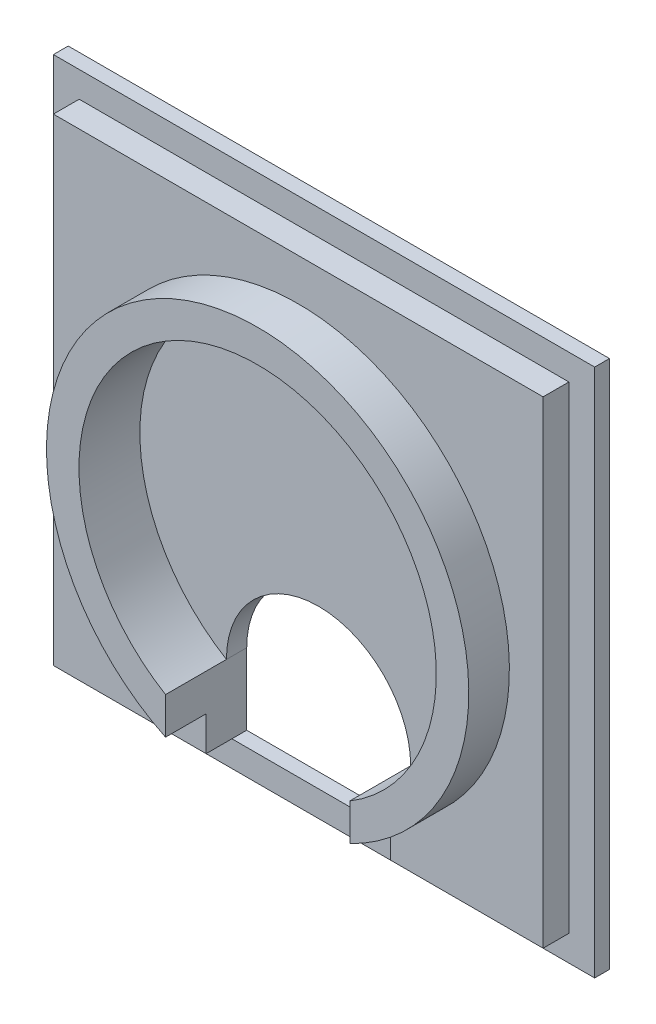
ISO-10303-21;
HEADER;
FILE_DESCRIPTION(('STEP AP214'),'2;1');
FILE_NAME('part.step','',(''),(''),'','','');
FILE_SCHEMA(('AUTOMOTIVE_DESIGN { 1 0 10303 214 1 1 1 1 }'));
ENDSEC;
DATA;
#1=APPLICATION_CONTEXT('core data for automotive mechanical design processes');
#2=APPLICATION_PROTOCOL_DEFINITION('international standard','automotive_design',2000,#1);
#3=PRODUCT_CONTEXT('',#1,'mechanical');
#4=PRODUCT('Part','Part','',(#3));
#5=PRODUCT_RELATED_PRODUCT_CATEGORY('part','',(#4));
#6=PRODUCT_DEFINITION_FORMATION('','',#4);
#7=PRODUCT_DEFINITION_CONTEXT('part definition',#1,'design');
#8=PRODUCT_DEFINITION('design','',#6,#7);
#9=PRODUCT_DEFINITION_SHAPE('','',#8);
#10=(LENGTH_UNIT() NAMED_UNIT(*) SI_UNIT(.MILLI.,.METRE.));
#11=(NAMED_UNIT(*) PLANE_ANGLE_UNIT() SI_UNIT($,.RADIAN.));
#12=(NAMED_UNIT(*) SI_UNIT($,.STERADIAN.) SOLID_ANGLE_UNIT());
#13=UNCERTAINTY_MEASURE_WITH_UNIT(LENGTH_MEASURE(1.E-05),#10,'distance_accuracy_value','');
#14=(GEOMETRIC_REPRESENTATION_CONTEXT(3) GLOBAL_UNCERTAINTY_ASSIGNED_CONTEXT((#13)) GLOBAL_UNIT_ASSIGNED_CONTEXT((#10,
#11,#12)) REPRESENTATION_CONTEXT('',''));
#15=CARTESIAN_POINT('',(0.,0.,0.));
#16=DIRECTION('',(0.,0.,1.));
#17=DIRECTION('',(1.,0.,0.));
#18=AXIS2_PLACEMENT_3D('',#15,#16,#17);
#19=CARTESIAN_POINT('',(-30.15,-27.65,-5.));
#20=DIRECTION('',(0.,-1.,0.));
#21=DIRECTION('',(1.,0.,0.));
#22=AXIS2_PLACEMENT_3D('',#19,#20,#21);
#23=PLANE('',#22);
#24=DIRECTION('',(0.,0.,1.));
#25=VECTOR('',#24,1.);
#26=CARTESIAN_POINT('',(11.3436105363328,-27.65,-28.875));
#27=LINE('',#26,#25);
#28=CARTESIAN_POINT('',(11.3436105363328,-27.65,-3.17500000000001));
#29=VERTEX_POINT('',#28);
#30=CARTESIAN_POINT('',(11.3436105363328,-27.65,0.));
#31=VERTEX_POINT('',#30);
#32=EDGE_CURVE('E270',#29,#31,#27,.T.);
#33=ORIENTED_EDGE('',*,*,#32,.F.);
#34=DIRECTION('',(1.,0.,0.));
#35=VECTOR('',#34,1.);
#36=CARTESIAN_POINT('',(-30.15,-27.65,-3.175));
#37=LINE('',#36,#35);
#38=CARTESIAN_POINT('',(30.15,-27.65,-3.175));
#39=VERTEX_POINT('',#38);
#40=EDGE_CURVE('E224',#29,#39,#37,.T.);
#41=ORIENTED_EDGE('',*,*,#40,.T.);
#42=DIRECTION('',(0.,0.,1.));
#43=VECTOR('',#42,1.);
#44=CARTESIAN_POINT('',(30.15,-27.65,-5.));
#45=LINE('',#44,#43);
#46=CARTESIAN_POINT('',(30.15,-27.65,0.));
#47=VERTEX_POINT('',#46);
#48=EDGE_CURVE('E174',#39,#47,#45,.T.);
#49=ORIENTED_EDGE('',*,*,#48,.T.);
#50=DIRECTION('',(1.,0.,0.));
#51=VECTOR('',#50,1.);
#52=CARTESIAN_POINT('',(-30.15,-27.65,0.));
#53=LINE('',#52,#51);
#54=EDGE_CURVE('E186',#31,#47,#53,.T.);
#55=ORIENTED_EDGE('',*,*,#54,.F.);
#56=EDGE_LOOP('',(#33,#41,#49,#55));
#57=FACE_BOUND('',#56,.T.);
#58=ADVANCED_FACE('F35',(#57),#23,.T.);
#59=CARTESIAN_POINT('',(30.15,31.15,-5.));
#60=DIRECTION('',(1.,0.,0.));
#61=DIRECTION('',(0.,0.,-1.));
#62=AXIS2_PLACEMENT_3D('',#59,#60,#61);
#63=PLANE('',#62);
#64=ORIENTED_EDGE('',*,*,#48,.F.);
#65=DIRECTION('',(0.,1.,0.));
#66=VECTOR('',#65,1.);
#67=CARTESIAN_POINT('',(30.15,31.15,-3.175));
#68=LINE('',#67,#66);
#69=CARTESIAN_POINT('',(30.15,31.15,-3.175));
#70=VERTEX_POINT('',#69);
#71=EDGE_CURVE('E211',#39,#70,#68,.T.);
#72=ORIENTED_EDGE('',*,*,#71,.T.);
#73=DIRECTION('',(0.,0.,1.));
#74=VECTOR('',#73,1.);
#75=CARTESIAN_POINT('',(30.15,31.15,-5.));
#76=LINE('',#75,#74);
#77=CARTESIAN_POINT('',(30.15,31.15,0.));
#78=VERTEX_POINT('',#77);
#79=EDGE_CURVE('E175',#70,#78,#76,.T.);
#80=ORIENTED_EDGE('',*,*,#79,.T.);
#81=DIRECTION('',(0.,1.,0.));
#82=VECTOR('',#81,1.);
#83=CARTESIAN_POINT('',(30.15,31.15,0.));
#84=LINE('',#83,#82);
#85=EDGE_CURVE('E193',#47,#78,#84,.T.);
#86=ORIENTED_EDGE('',*,*,#85,.F.);
#87=EDGE_LOOP('',(#64,#72,#80,#86));
#88=FACE_BOUND('',#87,.T.);
#89=ADVANCED_FACE('F37',(#88),#63,.T.);
#90=DIRECTION('',(0.,0.,1.));
#91=VECTOR('',#90,1.);
#92=CARTESIAN_POINT('',(-11.3436105363328,-27.65,-28.875));
#93=LINE('',#92,#91);
#94=CARTESIAN_POINT('',(-11.3436105363328,-27.65,-3.175));
#95=VERTEX_POINT('',#94);
#96=CARTESIAN_POINT('',(-11.3436105363328,-27.65,0.));
#97=VERTEX_POINT('',#96);
#98=EDGE_CURVE('E162',#95,#97,#93,.T.);
#99=ORIENTED_EDGE('',*,*,#98,.T.);
#100=CARTESIAN_POINT('',(-30.15,-27.65,0.));
#101=VERTEX_POINT('',#100);
#102=EDGE_CURVE('E178',#101,#97,#53,.T.);
#103=ORIENTED_EDGE('',*,*,#102,.F.);
#104=DIRECTION('',(0.,0.,1.));
#105=VECTOR('',#104,1.);
#106=CARTESIAN_POINT('',(-30.15,-27.65,-5.));
#107=LINE('',#106,#105);
#108=CARTESIAN_POINT('',(-30.15,-27.65,-3.175));
#109=VERTEX_POINT('',#108);
#110=EDGE_CURVE('E180',#109,#101,#107,.T.);
#111=ORIENTED_EDGE('',*,*,#110,.F.);
#112=EDGE_CURVE('E221',#109,#95,#37,.T.);
#113=ORIENTED_EDGE('',*,*,#112,.T.);
#114=EDGE_LOOP('',(#99,#103,#111,#113));
#115=FACE_BOUND('',#114,.T.);
#116=ADVANCED_FACE('F307',(#115),#23,.T.);
#117=CARTESIAN_POINT('',(-30.15,31.15,-5.));
#118=DIRECTION('',(-1.,0.,0.));
#119=DIRECTION('',(0.,0.,1.));
#120=AXIS2_PLACEMENT_3D('',#117,#118,#119);
#121=PLANE('',#120);
#122=DIRECTION('',(0.,0.,1.));
#123=VECTOR('',#122,1.);
#124=CARTESIAN_POINT('',(-30.15,31.15,-5.));
#125=LINE('',#124,#123);
#126=CARTESIAN_POINT('',(-30.15,31.15,-3.175));
#127=VERTEX_POINT('',#126);
#128=CARTESIAN_POINT('',(-30.15,31.15,0.));
#129=VERTEX_POINT('',#128);
#130=EDGE_CURVE('E177',#127,#129,#125,.T.);
#131=ORIENTED_EDGE('',*,*,#130,.F.);
#132=DIRECTION('',(0.,-1.,0.));
#133=VECTOR('',#132,1.);
#134=CARTESIAN_POINT('',(-30.15,31.15,-3.175));
#135=LINE('',#134,#133);
#136=EDGE_CURVE('E225',#127,#109,#135,.T.);
#137=ORIENTED_EDGE('',*,*,#136,.T.);
#138=ORIENTED_EDGE('',*,*,#110,.T.);
#139=DIRECTION('',(0.,-1.,0.));
#140=VECTOR('',#139,1.);
#141=CARTESIAN_POINT('',(-30.15,31.15,0.));
#142=LINE('',#141,#140);
#143=EDGE_CURVE('E187',#129,#101,#142,.T.);
#144=ORIENTED_EDGE('',*,*,#143,.F.);
#145=EDGE_LOOP('',(#131,#137,#138,#144));
#146=FACE_BOUND('',#145,.T.);
#147=ADVANCED_FACE('F312',(#146),#121,.T.);
#148=CARTESIAN_POINT('',(-30.15,31.15,-5.));
#149=DIRECTION('',(0.,1.,0.));
#150=DIRECTION('',(0.,0.,1.));
#151=AXIS2_PLACEMENT_3D('',#148,#149,#150);
#152=PLANE('',#151);
#153=ORIENTED_EDGE('',*,*,#79,.F.);
#154=DIRECTION('',(-1.,0.,0.));
#155=VECTOR('',#154,1.);
#156=CARTESIAN_POINT('',(-30.15,31.15,-3.175));
#157=LINE('',#156,#155);
#158=EDGE_CURVE('E228',#70,#127,#157,.T.);
#159=ORIENTED_EDGE('',*,*,#158,.T.);
#160=ORIENTED_EDGE('',*,*,#130,.T.);
#161=DIRECTION('',(-1.,0.,0.));
#162=VECTOR('',#161,1.);
#163=CARTESIAN_POINT('',(-30.15,31.15,0.));
#164=LINE('',#163,#162);
#165=EDGE_CURVE('E190',#78,#129,#164,.T.);
#166=ORIENTED_EDGE('',*,*,#165,.F.);
#167=EDGE_LOOP('',(#153,#159,#160,#166));
#168=FACE_BOUND('',#167,.T.);
#169=ADVANCED_FACE('F314',(#168),#152,.T.);
#170=CARTESIAN_POINT('',(0.,0.,-5.));
#171=DIRECTION('',(0.,0.,1.));
#172=DIRECTION('',(1.,0.,0.));
#173=AXIS2_PLACEMENT_3D('',#170,#171,#172);
#174=CYLINDRICAL_SURFACE('',#173,22.);
#175=CARTESIAN_POINT('',(0.,0.,-2.5));
#176=DIRECTION('',(0.,0.,1.));
#177=DIRECTION('',(1.,0.,0.));
#178=AXIS2_PLACEMENT_3D('',#175,#176,#177);
#179=CIRCLE('',#178,22.);
#180=CARTESIAN_POINT('',(-11.3436105363328,-18.85,-2.50000000000001));
#181=VERTEX_POINT('',#180);
#182=CARTESIAN_POINT('',(11.3436105363328,-18.85,-2.50000000000001));
#183=VERTEX_POINT('',#182);
#184=EDGE_CURVE('E153',#181,#183,#179,.F.);
#185=ORIENTED_EDGE('',*,*,#184,.T.);
#186=DIRECTION('',(0.,0.,-1.));
#187=VECTOR('',#186,1.);
#188=CARTESIAN_POINT('',(11.3436105363328,-18.85,5.));
#189=LINE('',#188,#187);
#190=CARTESIAN_POINT('',(11.3436105363328,-18.85,5.));
#191=VERTEX_POINT('',#190);
#192=EDGE_CURVE('E196',#191,#183,#189,.T.);
#193=ORIENTED_EDGE('',*,*,#192,.F.);
#194=CARTESIAN_POINT('',(0.,0.,5.));
#195=DIRECTION('',(0.,0.,1.));
#196=DIRECTION('',(1.,0.,0.));
#197=AXIS2_PLACEMENT_3D('',#194,#195,#196);
#198=CIRCLE('',#197,22.);
#199=CARTESIAN_POINT('',(-11.3436105363328,-18.85,5.));
#200=VERTEX_POINT('',#199);
#201=EDGE_CURVE('E210',#200,#191,#198,.F.);
#202=ORIENTED_EDGE('',*,*,#201,.F.);
#203=DIRECTION('',(0.,0.,-1.));
#204=VECTOR('',#203,1.);
#205=CARTESIAN_POINT('',(-11.3436105363328,-18.85,5.));
#206=LINE('',#205,#204);
#207=EDGE_CURVE('E204',#200,#181,#206,.T.);
#208=ORIENTED_EDGE('',*,*,#207,.T.);
#209=EDGE_LOOP('',(#185,#193,#202,#208));
#210=FACE_BOUND('',#209,.T.);
#211=ADVANCED_FACE('F304',(#210),#174,.F.);
#212=CARTESIAN_POINT('',(0.,0.,0.));
#213=DIRECTION('',(0.,0.,1.));
#214=DIRECTION('',(1.,0.,0.));
#215=AXIS2_PLACEMENT_3D('',#212,#213,#214);
#216=PLANE('',#215);
#217=DIRECTION('',(0.,1.,0.));
#218=VECTOR('',#217,1.);
#219=CARTESIAN_POINT('',(11.3436105363328,0.,0.));
#220=LINE('',#219,#218);
#221=CARTESIAN_POINT('',(11.3436105363328,-23.3949246632683,0.));
#222=VERTEX_POINT('',#221);
#223=EDGE_CURVE('E260',#31,#222,#220,.T.);
#224=ORIENTED_EDGE('',*,*,#223,.F.);
#225=ORIENTED_EDGE('',*,*,#54,.T.);
#226=ORIENTED_EDGE('',*,*,#85,.T.);
#227=ORIENTED_EDGE('',*,*,#165,.T.);
#228=ORIENTED_EDGE('',*,*,#143,.T.);
#229=ORIENTED_EDGE('',*,*,#102,.T.);
#230=DIRECTION('',(0.,-1.,0.));
#231=VECTOR('',#230,1.);
#232=CARTESIAN_POINT('',(-11.3436105363328,0.,0.));
#233=LINE('',#232,#231);
#234=CARTESIAN_POINT('',(-11.3436105363328,-23.3949246632683,0.));
#235=VERTEX_POINT('',#234);
#236=EDGE_CURVE('E265',#235,#97,#233,.T.);
#237=ORIENTED_EDGE('',*,*,#236,.F.);
#238=CARTESIAN_POINT('',(0.,0.,0.));
#239=DIRECTION('',(0.,0.,1.));
#240=DIRECTION('',(1.,0.,0.));
#241=AXIS2_PLACEMENT_3D('',#238,#239,#240);
#242=CIRCLE('',#241,26.);
#243=EDGE_CURVE('E207',#222,#235,#242,.T.);
#244=ORIENTED_EDGE('',*,*,#243,.F.);
#245=EDGE_LOOP('',(#224,#225,#226,#227,#228,#229,#237,#244));
#246=FACE_BOUND('',#245,.T.);
#247=ADVANCED_FACE('F289',(#246),#216,.T.);
#248=CARTESIAN_POINT('',(30.15,-18.85,-2.50000000000001));
#249=DIRECTION('',(0.,0.,1.));
#250=DIRECTION('',(1.,0.,0.));
#251=AXIS2_PLACEMENT_3D('',#248,#249,#250);
#252=PLANE('',#251);
#253=CARTESIAN_POINT('',(0.,-18.85,-2.50000000000001));
#254=DIRECTION('',(0.,0.,1.));
#255=DIRECTION('',(1.,0.,0.));
#256=AXIS2_PLACEMENT_3D('',#253,#254,#255);
#257=CIRCLE('',#256,11.3436105363328);
#258=EDGE_CURVE('E160',#183,#181,#257,.T.);
#259=ORIENTED_EDGE('',*,*,#258,.F.);
#260=ORIENTED_EDGE('',*,*,#184,.F.);
#261=EDGE_LOOP('',(#259,#260));
#262=FACE_BOUND('',#261,.T.);
#263=ADVANCED_FACE('F303',(#262),#252,.T.);
#264=CARTESIAN_POINT('',(11.3436105363328,0.,5.));
#265=DIRECTION('',(-1.,0.,0.));
#266=DIRECTION('',(0.,0.,1.));
#267=AXIS2_PLACEMENT_3D('',#264,#265,#266);
#268=PLANE('',#267);
#269=ORIENTED_EDGE('',*,*,#192,.T.);
#270=DIRECTION('',(0.,0.,1.));
#271=VECTOR('',#270,1.);
#272=CARTESIAN_POINT('',(11.3436105363328,-18.85,-28.875));
#273=LINE('',#272,#271);
#274=CARTESIAN_POINT('',(11.3436105363328,-18.85,-5.00000000000001));
#275=VERTEX_POINT('',#274);
#276=EDGE_CURVE('E266',#275,#183,#273,.T.);
#277=ORIENTED_EDGE('',*,*,#276,.F.);
#278=DIRECTION('',(0.,1.,0.));
#279=VECTOR('',#278,1.);
#280=CARTESIAN_POINT('',(11.3436105363328,0.,-5.));
#281=LINE('',#280,#279);
#282=CARTESIAN_POINT('',(11.3436105363328,-27.65,-5.00000000000001));
#283=VERTEX_POINT('',#282);
#284=EDGE_CURVE('E43',#283,#275,#281,.T.);
#285=ORIENTED_EDGE('',*,*,#284,.F.);
#286=EDGE_CURVE('E272',#283,#29,#27,.T.);
#287=ORIENTED_EDGE('',*,*,#286,.T.);
#288=ORIENTED_EDGE('',*,*,#32,.T.);
#289=ORIENTED_EDGE('',*,*,#223,.T.);
#290=DIRECTION('',(0.,0.,-1.));
#291=VECTOR('',#290,1.);
#292=CARTESIAN_POINT('',(11.3436105363328,-23.3949246632683,5.));
#293=LINE('',#292,#291);
#294=CARTESIAN_POINT('',(11.3436105363328,-23.3949246632683,5.));
#295=VERTEX_POINT('',#294);
#296=EDGE_CURVE('E199',#295,#222,#293,.T.);
#297=ORIENTED_EDGE('',*,*,#296,.F.);
#298=DIRECTION('',(0.,1.,0.));
#299=VECTOR('',#298,1.);
#300=CARTESIAN_POINT('',(11.3436105363328,0.,5.));
#301=LINE('',#300,#299);
#302=EDGE_CURVE('E215',#295,#191,#301,.T.);
#303=ORIENTED_EDGE('',*,*,#302,.T.);
#304=EDGE_LOOP('',(#269,#277,#285,#287,#288,#289,#297,#303));
#305=FACE_BOUND('',#304,.T.);
#306=ADVANCED_FACE('F274',(#305),#268,.T.);
#307=CARTESIAN_POINT('',(0.,0.,5.));
#308=DIRECTION('',(0.,0.,-1.));
#309=DIRECTION('',(-1.,0.,0.));
#310=AXIS2_PLACEMENT_3D('',#307,#308,#309);
#311=CYLINDRICAL_SURFACE('',#310,26.);
#312=ORIENTED_EDGE('',*,*,#243,.T.);
#313=DIRECTION('',(0.,0.,-1.));
#314=VECTOR('',#313,1.);
#315=CARTESIAN_POINT('',(-11.3436105363328,-23.3949246632683,5.));
#316=LINE('',#315,#314);
#317=CARTESIAN_POINT('',(-11.3436105363328,-23.3949246632683,5.));
#318=VERTEX_POINT('',#317);
#319=EDGE_CURVE('E202',#318,#235,#316,.T.);
#320=ORIENTED_EDGE('',*,*,#319,.F.);
#321=CARTESIAN_POINT('',(0.,0.,5.));
#322=DIRECTION('',(0.,0.,1.));
#323=DIRECTION('',(1.,0.,0.));
#324=AXIS2_PLACEMENT_3D('',#321,#322,#323);
#325=CIRCLE('',#324,26.);
#326=EDGE_CURVE('E213',#295,#318,#325,.T.);
#327=ORIENTED_EDGE('',*,*,#326,.F.);
#328=ORIENTED_EDGE('',*,*,#296,.T.);
#329=EDGE_LOOP('',(#312,#320,#327,#328));
#330=FACE_BOUND('',#329,.T.);
#331=ADVANCED_FACE('F293',(#330),#311,.T.);
#332=CARTESIAN_POINT('',(-11.3436105363328,0.,5.));
#333=DIRECTION('',(-1.,0.,0.));
#334=DIRECTION('',(0.,0.,1.));
#335=AXIS2_PLACEMENT_3D('',#332,#333,#334);
#336=PLANE('',#335);
#337=ORIENTED_EDGE('',*,*,#319,.T.);
#338=ORIENTED_EDGE('',*,*,#236,.T.);
#339=ORIENTED_EDGE('',*,*,#98,.F.);
#340=CARTESIAN_POINT('',(-11.3436105363328,-27.65,-5.));
#341=VERTEX_POINT('',#340);
#342=EDGE_CURVE('E50',#341,#95,#93,.T.);
#343=ORIENTED_EDGE('',*,*,#342,.F.);
#344=DIRECTION('',(0.,-1.,0.));
#345=VECTOR('',#344,1.);
#346=CARTESIAN_POINT('',(-11.3436105363328,0.,-5.));
#347=LINE('',#346,#345);
#348=CARTESIAN_POINT('',(-11.3436105363328,-18.85,-5.00000000000001));
#349=VERTEX_POINT('',#348);
#350=EDGE_CURVE('E143',#349,#341,#347,.T.);
#351=ORIENTED_EDGE('',*,*,#350,.F.);
#352=DIRECTION('',(0.,0.,1.));
#353=VECTOR('',#352,1.);
#354=CARTESIAN_POINT('',(-11.3436105363328,-18.85,-28.875));
#355=LINE('',#354,#353);
#356=EDGE_CURVE('E148',#349,#181,#355,.T.);
#357=ORIENTED_EDGE('',*,*,#356,.T.);
#358=ORIENTED_EDGE('',*,*,#207,.F.);
#359=DIRECTION('',(0.,1.,0.));
#360=VECTOR('',#359,1.);
#361=CARTESIAN_POINT('',(-11.3436105363328,0.,5.));
#362=LINE('',#361,#360);
#363=EDGE_CURVE('E206',#318,#200,#362,.T.);
#364=ORIENTED_EDGE('',*,*,#363,.F.);
#365=EDGE_LOOP('',(#337,#338,#339,#343,#351,#357,#358,#364));
#366=FACE_BOUND('',#365,.T.);
#367=ADVANCED_FACE('F146',(#366),#336,.F.);
#368=CARTESIAN_POINT('',(0.,0.,5.));
#369=DIRECTION('',(0.,0.,1.));
#370=DIRECTION('',(1.,0.,0.));
#371=AXIS2_PLACEMENT_3D('',#368,#369,#370);
#372=PLANE('',#371);
#373=ORIENTED_EDGE('',*,*,#201,.T.);
#374=ORIENTED_EDGE('',*,*,#302,.F.);
#375=ORIENTED_EDGE('',*,*,#326,.T.);
#376=ORIENTED_EDGE('',*,*,#363,.T.);
#377=EDGE_LOOP('',(#373,#374,#375,#376));
#378=FACE_BOUND('',#377,.T.);
#379=ADVANCED_FACE('F298',(#378),#372,.T.);
#380=CARTESIAN_POINT('',(33.325,34.325,-98.2027091880917));
#381=DIRECTION('',(1.,0.,0.));
#382=DIRECTION('',(0.,0.,-1.));
#383=AXIS2_PLACEMENT_3D('',#380,#381,#382);
#384=PLANE('',#383);
#385=DIRECTION('',(0.,-1.,0.));
#386=VECTOR('',#385,1.);
#387=CARTESIAN_POINT('',(33.325,34.325,-5.));
#388=LINE('',#387,#386);
#389=CARTESIAN_POINT('',(33.325,34.325,-5.));
#390=VERTEX_POINT('',#389);
#391=CARTESIAN_POINT('',(33.325,-30.825,-5.));
#392=VERTEX_POINT('',#391);
#393=EDGE_CURVE('E233',#390,#392,#388,.T.);
#394=ORIENTED_EDGE('',*,*,#393,.F.);
#395=DIRECTION('',(0.,0.,1.));
#396=VECTOR('',#395,1.);
#397=CARTESIAN_POINT('',(33.325,34.325,-98.2027091880917));
#398=LINE('',#397,#396);
#399=CARTESIAN_POINT('',(33.325,34.325,-3.175));
#400=VERTEX_POINT('',#399);
#401=EDGE_CURVE('E234',#390,#400,#398,.T.);
#402=ORIENTED_EDGE('',*,*,#401,.T.);
#403=DIRECTION('',(0.,1.,0.));
#404=VECTOR('',#403,1.);
#405=CARTESIAN_POINT('',(33.325,34.325,-3.175));
#406=LINE('',#405,#404);
#407=CARTESIAN_POINT('',(33.325,-30.825,-3.175));
#408=VERTEX_POINT('',#407);
#409=EDGE_CURVE('E252',#408,#400,#406,.T.);
#410=ORIENTED_EDGE('',*,*,#409,.F.);
#411=DIRECTION('',(0.,0.,1.));
#412=VECTOR('',#411,1.);
#413=CARTESIAN_POINT('',(33.325,-30.825,-98.2027091880917));
#414=LINE('',#413,#412);
#415=EDGE_CURVE('E241',#392,#408,#414,.T.);
#416=ORIENTED_EDGE('',*,*,#415,.F.);
#417=EDGE_LOOP('',(#394,#402,#410,#416));
#418=FACE_BOUND('',#417,.T.);
#419=ADVANCED_FACE('F351',(#418),#384,.T.);
#420=CARTESIAN_POINT('',(33.325,-30.825,-98.2027091880917));
#421=DIRECTION('',(0.,-1.,0.));
#422=DIRECTION('',(0.,0.,-1.));
#423=AXIS2_PLACEMENT_3D('',#420,#421,#422);
#424=PLANE('',#423);
#425=DIRECTION('',(-1.,0.,0.));
#426=VECTOR('',#425,1.);
#427=CARTESIAN_POINT('',(33.325,-30.825,-5.));
#428=LINE('',#427,#426);
#429=CARTESIAN_POINT('',(-33.325,-30.825,-5.));
#430=VERTEX_POINT('',#429);
#431=EDGE_CURVE('E256',#392,#430,#428,.T.);
#432=ORIENTED_EDGE('',*,*,#431,.F.);
#433=ORIENTED_EDGE('',*,*,#415,.T.);
#434=DIRECTION('',(1.,0.,0.));
#435=VECTOR('',#434,1.);
#436=CARTESIAN_POINT('',(33.325,-30.825,-3.175));
#437=LINE('',#436,#435);
#438=CARTESIAN_POINT('',(-33.325,-30.825,-3.175));
#439=VERTEX_POINT('',#438);
#440=EDGE_CURVE('E237',#439,#408,#437,.T.);
#441=ORIENTED_EDGE('',*,*,#440,.F.);
#442=DIRECTION('',(0.,0.,1.));
#443=VECTOR('',#442,1.);
#444=CARTESIAN_POINT('',(-33.325,-30.825,-98.2027091880917));
#445=LINE('',#444,#443);
#446=EDGE_CURVE('E239',#430,#439,#445,.T.);
#447=ORIENTED_EDGE('',*,*,#446,.F.);
#448=EDGE_LOOP('',(#432,#433,#441,#447));
#449=FACE_BOUND('',#448,.T.);
#450=ADVANCED_FACE('F356',(#449),#424,.T.);
#451=CARTESIAN_POINT('',(-33.325,34.325,-98.2027091880917));
#452=DIRECTION('',(-1.,0.,0.));
#453=DIRECTION('',(0.,0.,1.));
#454=AXIS2_PLACEMENT_3D('',#451,#452,#453);
#455=PLANE('',#454);
#456=DIRECTION('',(0.,1.,0.));
#457=VECTOR('',#456,1.);
#458=CARTESIAN_POINT('',(-33.325,34.325,-5.));
#459=LINE('',#458,#457);
#460=CARTESIAN_POINT('',(-33.325,34.325,-5.00000000000003));
#461=VERTEX_POINT('',#460);
#462=EDGE_CURVE('E243',#430,#461,#459,.T.);
#463=ORIENTED_EDGE('',*,*,#462,.F.);
#464=ORIENTED_EDGE('',*,*,#446,.T.);
#465=DIRECTION('',(0.,-1.,0.));
#466=VECTOR('',#465,1.);
#467=CARTESIAN_POINT('',(-33.325,34.325,-3.175));
#468=LINE('',#467,#466);
#469=CARTESIAN_POINT('',(-33.325,34.325,-3.175));
#470=VERTEX_POINT('',#469);
#471=EDGE_CURVE('E246',#470,#439,#468,.T.);
#472=ORIENTED_EDGE('',*,*,#471,.F.);
#473=DIRECTION('',(0.,0.,1.));
#474=VECTOR('',#473,1.);
#475=CARTESIAN_POINT('',(-33.325,34.325,-98.2027091880917));
#476=LINE('',#475,#474);
#477=EDGE_CURVE('E236',#461,#470,#476,.T.);
#478=ORIENTED_EDGE('',*,*,#477,.F.);
#479=EDGE_LOOP('',(#463,#464,#472,#478));
#480=FACE_BOUND('',#479,.T.);
#481=ADVANCED_FACE('F367',(#480),#455,.T.);
#482=CARTESIAN_POINT('',(33.325,34.325,-98.2027091880917));
#483=DIRECTION('',(0.,1.,0.));
#484=DIRECTION('',(0.,0.,1.));
#485=AXIS2_PLACEMENT_3D('',#482,#483,#484);
#486=PLANE('',#485);
#487=DIRECTION('',(1.,0.,0.));
#488=VECTOR('',#487,1.);
#489=CARTESIAN_POINT('',(33.325,34.325,-5.));
#490=LINE('',#489,#488);
#491=EDGE_CURVE('E231',#461,#390,#490,.T.);
#492=ORIENTED_EDGE('',*,*,#491,.F.);
#493=ORIENTED_EDGE('',*,*,#477,.T.);
#494=DIRECTION('',(-1.,0.,0.));
#495=VECTOR('',#494,1.);
#496=CARTESIAN_POINT('',(33.325,34.325,-3.175));
#497=LINE('',#496,#495);
#498=EDGE_CURVE('E249',#400,#470,#497,.T.);
#499=ORIENTED_EDGE('',*,*,#498,.F.);
#500=ORIENTED_EDGE('',*,*,#401,.F.);
#501=EDGE_LOOP('',(#492,#493,#499,#500));
#502=FACE_BOUND('',#501,.T.);
#503=ADVANCED_FACE('F377',(#502),#486,.T.);
#504=CARTESIAN_POINT('',(0.,0.,-3.175));
#505=DIRECTION('',(0.,0.,-1.));
#506=DIRECTION('',(-1.,0.,0.));
#507=AXIS2_PLACEMENT_3D('',#504,#505,#506);
#508=PLANE('',#507);
#509=ORIENTED_EDGE('',*,*,#71,.F.);
#510=ORIENTED_EDGE('',*,*,#40,.F.);
#511=DIRECTION('',(-1.,0.,0.));
#512=VECTOR('',#511,1.);
#513=CARTESIAN_POINT('',(0.,-27.65,-3.175));
#514=LINE('',#513,#512);
#515=EDGE_CURVE('E262',#29,#95,#514,.T.);
#516=ORIENTED_EDGE('',*,*,#515,.T.);
#517=ORIENTED_EDGE('',*,*,#112,.F.);
#518=ORIENTED_EDGE('',*,*,#136,.F.);
#519=ORIENTED_EDGE('',*,*,#158,.F.);
#520=EDGE_LOOP('',(#509,#510,#516,#517,#518,#519));
#521=FACE_BOUND('',#520,.T.);
#522=ORIENTED_EDGE('',*,*,#409,.T.);
#523=ORIENTED_EDGE('',*,*,#498,.T.);
#524=ORIENTED_EDGE('',*,*,#471,.T.);
#525=ORIENTED_EDGE('',*,*,#440,.T.);
#526=EDGE_LOOP('',(#522,#523,#524,#525));
#527=FACE_BOUND('',#526,.T.);
#528=ADVANCED_FACE('F281',(#521,#527),#508,.F.);
#529=CARTESIAN_POINT('',(0.,0.,-5.));
#530=DIRECTION('',(0.,0.,1.));
#531=DIRECTION('',(1.,0.,0.));
#532=AXIS2_PLACEMENT_3D('',#529,#530,#531);
#533=PLANE('',#532);
#534=ORIENTED_EDGE('',*,*,#284,.T.);
#535=CARTESIAN_POINT('',(0.,-18.85,-5.));
#536=DIRECTION('',(0.,0.,1.));
#537=DIRECTION('',(1.,0.,0.));
#538=AXIS2_PLACEMENT_3D('',#535,#536,#537);
#539=CIRCLE('',#538,11.3436105363328);
#540=EDGE_CURVE('E11',#275,#349,#539,.T.);
#541=ORIENTED_EDGE('',*,*,#540,.T.);
#542=ORIENTED_EDGE('',*,*,#350,.T.);
#543=DIRECTION('',(1.,0.,0.));
#544=VECTOR('',#543,1.);
#545=CARTESIAN_POINT('',(0.,-27.65,-5.));
#546=LINE('',#545,#544);
#547=EDGE_CURVE('E152',#341,#283,#546,.T.);
#548=ORIENTED_EDGE('',*,*,#547,.T.);
#549=EDGE_LOOP('',(#534,#541,#542,#548));
#550=FACE_BOUND('',#549,.T.);
#551=ORIENTED_EDGE('',*,*,#393,.T.);
#552=ORIENTED_EDGE('',*,*,#431,.T.);
#553=ORIENTED_EDGE('',*,*,#462,.T.);
#554=ORIENTED_EDGE('',*,*,#491,.T.);
#555=EDGE_LOOP('',(#551,#552,#553,#554));
#556=FACE_BOUND('',#555,.T.);
#557=ADVANCED_FACE('F165',(#550,#556),#533,.F.);
#558=CARTESIAN_POINT('',(0.,-18.85,-28.875));
#559=DIRECTION('',(0.,0.,1.));
#560=DIRECTION('',(1.,0.,0.));
#561=AXIS2_PLACEMENT_3D('',#558,#559,#560);
#562=CYLINDRICAL_SURFACE('',#561,11.3436105363328);
#563=ORIENTED_EDGE('',*,*,#258,.T.);
#564=ORIENTED_EDGE('',*,*,#356,.F.);
#565=ORIENTED_EDGE('',*,*,#540,.F.);
#566=ORIENTED_EDGE('',*,*,#276,.T.);
#567=EDGE_LOOP('',(#563,#564,#565,#566));
#568=FACE_BOUND('',#567,.T.);
#569=ADVANCED_FACE('F157',(#568),#562,.F.);
#570=CARTESIAN_POINT('',(-11.3436105363328,-27.65,-28.875));
#571=DIRECTION('',(0.,-1.,0.));
#572=DIRECTION('',(0.,0.,-1.));
#573=AXIS2_PLACEMENT_3D('',#570,#571,#572);
#574=PLANE('',#573);
#575=ORIENTED_EDGE('',*,*,#286,.F.);
#576=ORIENTED_EDGE('',*,*,#547,.F.);
#577=ORIENTED_EDGE('',*,*,#342,.T.);
#578=ORIENTED_EDGE('',*,*,#515,.F.);
#579=EDGE_LOOP('',(#575,#576,#577,#578));
#580=FACE_BOUND('',#579,.T.);
#581=ADVANCED_FACE('F434',(#580),#574,.F.);
#582=CLOSED_SHELL('',(#58,#89,#116,#147,#169,#211,#247,#263,#306,#331,#367,#379,#419,#450,#481,
#503,#528,#557,#569,#581));
#583=MANIFOLD_SOLID_BREP('B2',#582);
#584=ADVANCED_BREP_SHAPE_REPRESENTATION('',(#18,#583),#14);
#585=SHAPE_DEFINITION_REPRESENTATION(#9,#584);
ENDSEC;
END-ISO-10303-21;
